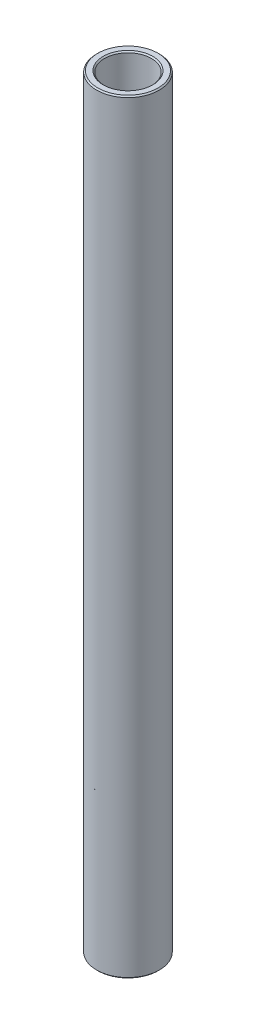
ISO-10303-21;
HEADER;
FILE_DESCRIPTION(('STEP AP214'),'2;1');
FILE_NAME('part.step','',(''),(''),'','','');
FILE_SCHEMA(('AUTOMOTIVE_DESIGN { 1 0 10303 214 1 1 1 1 }'));
ENDSEC;
DATA;
#1=APPLICATION_CONTEXT('core data for automotive mechanical design processes');
#2=APPLICATION_PROTOCOL_DEFINITION('international standard','automotive_design',2000,#1);
#3=PRODUCT_CONTEXT('',#1,'mechanical');
#4=PRODUCT('Part','Part','',(#3));
#5=PRODUCT_RELATED_PRODUCT_CATEGORY('part','',(#4));
#6=PRODUCT_DEFINITION_FORMATION('','',#4);
#7=PRODUCT_DEFINITION_CONTEXT('part definition',#1,'design');
#8=PRODUCT_DEFINITION('design','',#6,#7);
#9=PRODUCT_DEFINITION_SHAPE('','',#8);
#10=(LENGTH_UNIT() NAMED_UNIT(*) SI_UNIT(.MILLI.,.METRE.));
#11=(NAMED_UNIT(*) PLANE_ANGLE_UNIT() SI_UNIT($,.RADIAN.));
#12=(NAMED_UNIT(*) SI_UNIT($,.STERADIAN.) SOLID_ANGLE_UNIT());
#13=UNCERTAINTY_MEASURE_WITH_UNIT(LENGTH_MEASURE(1.E-05),#10,'distance_accuracy_value','');
#14=(GEOMETRIC_REPRESENTATION_CONTEXT(3) GLOBAL_UNCERTAINTY_ASSIGNED_CONTEXT((#13)) GLOBAL_UNIT_ASSIGNED_CONTEXT((#10,
#11,#12)) REPRESENTATION_CONTEXT('',''));
#15=CARTESIAN_POINT('',(0.,0.,0.));
#16=DIRECTION('',(0.,0.,1.));
#17=DIRECTION('',(1.,0.,0.));
#18=AXIS2_PLACEMENT_3D('',#15,#16,#17);
#19=CARTESIAN_POINT('',(0.,11.60859375,0.));
#20=DIRECTION('',(0.,1.,0.));
#21=DIRECTION('',(-1.,0.,0.));
#22=AXIS2_PLACEMENT_3D('',#19,#20,#21);
#23=CYLINDRICAL_SURFACE('',#22,4.7625);
#24=CARTESIAN_POINT('',(0.,-77.136625,0.));
#25=DIRECTION('',(0.,1.,0.));
#26=DIRECTION('',(-1.,0.,0.));
#27=AXIS2_PLACEMENT_3D('',#24,#25,#26);
#28=CIRCLE('',#27,4.7625);
#29=CARTESIAN_POINT('',(-4.76250000000001,-77.136625,0.));
#30=VERTEX_POINT('',#29);
#31=EDGE_CURVE('E50',#30,#30,#28,.F.);
#32=ORIENTED_EDGE('',*,*,#31,.T.);
#33=EDGE_LOOP('',(#32));
#34=FACE_BOUND('',#33,.T.);
#35=CARTESIAN_POINT('',(0.,77.136625,0.));
#36=DIRECTION('',(0.,-1.,0.));
#37=DIRECTION('',(1.,0.,0.));
#38=AXIS2_PLACEMENT_3D('',#35,#36,#37);
#39=CIRCLE('',#38,4.7625);
#40=CARTESIAN_POINT('',(4.76250000000001,77.136625,0.));
#41=VERTEX_POINT('',#40);
#42=EDGE_CURVE('E53',#41,#41,#39,.F.);
#43=ORIENTED_EDGE('',*,*,#42,.T.);
#44=EDGE_LOOP('',(#43));
#45=FACE_BOUND('',#44,.T.);
#46=ADVANCED_FACE('F30',(#34,#45),#23,.F.);
#47=CARTESIAN_POINT('',(4.76249999999999,77.390625,0.));
#48=DIRECTION('',(0.,-1.,0.));
#49=DIRECTION('',(1.,0.,0.));
#50=AXIS2_PLACEMENT_3D('',#47,#48,#49);
#51=PLANE('',#50);
#52=CARTESIAN_POINT('',(0.,77.390625,0.));
#53=DIRECTION('',(0.,-1.,0.));
#54=DIRECTION('',(1.,0.,0.));
#55=AXIS2_PLACEMENT_3D('',#52,#53,#54);
#56=CIRCLE('',#55,6.09599999999999);
#57=CARTESIAN_POINT('',(6.096,77.390625,0.));
#58=VERTEX_POINT('',#57);
#59=EDGE_CURVE('E10',#58,#58,#56,.F.);
#60=ORIENTED_EDGE('',*,*,#59,.T.);
#61=EDGE_LOOP('',(#60));
#62=FACE_BOUND('',#61,.T.);
#63=CARTESIAN_POINT('',(0.,77.390625,0.));
#64=DIRECTION('',(0.,-1.,0.));
#65=DIRECTION('',(1.,0.,0.));
#66=AXIS2_PLACEMENT_3D('',#63,#64,#65);
#67=CIRCLE('',#66,5.01650000000001);
#68=CARTESIAN_POINT('',(5.01650000000002,77.390625,0.));
#69=VERTEX_POINT('',#68);
#70=EDGE_CURVE('E37',#69,#69,#67,.T.);
#71=ORIENTED_EDGE('',*,*,#70,.T.);
#72=EDGE_LOOP('',(#71));
#73=FACE_BOUND('',#72,.T.);
#74=ADVANCED_FACE('F76',(#62,#73),#51,.F.);
#75=CARTESIAN_POINT('',(0.,11.60859375,0.));
#76=DIRECTION('',(0.,1.,0.));
#77=DIRECTION('',(-1.,0.,0.));
#78=AXIS2_PLACEMENT_3D('',#75,#76,#77);
#79=CYLINDRICAL_SURFACE('',#78,6.35);
#80=CARTESIAN_POINT('',(0.,-77.136625,0.));
#81=DIRECTION('',(0.,1.,0.));
#82=DIRECTION('',(-1.,0.,0.));
#83=AXIS2_PLACEMENT_3D('',#80,#81,#82);
#84=CIRCLE('',#83,6.35);
#85=CARTESIAN_POINT('',(-6.35000000000001,-77.136625,0.));
#86=VERTEX_POINT('',#85);
#87=EDGE_CURVE('E41',#86,#86,#84,.T.);
#88=ORIENTED_EDGE('',*,*,#87,.T.);
#89=EDGE_LOOP('',(#88));
#90=FACE_BOUND('',#89,.T.);
#91=CARTESIAN_POINT('',(0.,77.136625,0.));
#92=DIRECTION('',(0.,-1.,0.));
#93=DIRECTION('',(1.,0.,0.));
#94=AXIS2_PLACEMENT_3D('',#91,#92,#93);
#95=CIRCLE('',#94,6.35);
#96=CARTESIAN_POINT('',(6.35000000000001,77.136625,0.));
#97=VERTEX_POINT('',#96);
#98=EDGE_CURVE('E45',#97,#97,#95,.T.);
#99=ORIENTED_EDGE('',*,*,#98,.T.);
#100=EDGE_LOOP('',(#99));
#101=FACE_BOUND('',#100,.T.);
#102=ADVANCED_FACE('F73',(#90,#101),#79,.T.);
#103=CARTESIAN_POINT('',(6.35000000000001,-77.390625,0.));
#104=DIRECTION('',(0.,1.,0.));
#105=DIRECTION('',(-1.,0.,0.));
#106=AXIS2_PLACEMENT_3D('',#103,#104,#105);
#107=PLANE('',#106);
#108=CARTESIAN_POINT('',(0.,-77.390625,0.));
#109=DIRECTION('',(0.,1.,0.));
#110=DIRECTION('',(-1.,0.,0.));
#111=AXIS2_PLACEMENT_3D('',#108,#109,#110);
#112=CIRCLE('',#111,5.01650000000001);
#113=CARTESIAN_POINT('',(-5.01650000000001,-77.390625,0.));
#114=VERTEX_POINT('',#113);
#115=EDGE_CURVE('E56',#114,#114,#112,.T.);
#116=ORIENTED_EDGE('',*,*,#115,.T.);
#117=EDGE_LOOP('',(#116));
#118=FACE_BOUND('',#117,.T.);
#119=CARTESIAN_POINT('',(0.,-77.390625,0.));
#120=DIRECTION('',(0.,1.,0.));
#121=DIRECTION('',(-1.,0.,0.));
#122=AXIS2_PLACEMENT_3D('',#119,#120,#121);
#123=CIRCLE('',#122,6.09600000000003);
#124=CARTESIAN_POINT('',(-6.09600000000004,-77.390625,0.));
#125=VERTEX_POINT('',#124);
#126=EDGE_CURVE('E59',#125,#125,#123,.F.);
#127=ORIENTED_EDGE('',*,*,#126,.T.);
#128=EDGE_LOOP('',(#127));
#129=FACE_BOUND('',#128,.T.);
#130=ADVANCED_FACE('F63',(#118,#129),#107,.F.);
#131=CARTESIAN_POINT('',(0.,-77.390625,0.));
#132=DIRECTION('',(0.,-1.,0.));
#133=DIRECTION('',(1.,0.,0.));
#134=AXIS2_PLACEMENT_3D('',#131,#132,#133);
#135=CONICAL_SURFACE('',#134,5.01650000000001,0.785398163397453);
#136=ORIENTED_EDGE('',*,*,#31,.F.);
#137=EDGE_LOOP('',(#136));
#138=FACE_BOUND('',#137,.T.);
#139=ORIENTED_EDGE('',*,*,#115,.F.);
#140=EDGE_LOOP('',(#139));
#141=FACE_BOUND('',#140,.T.);
#142=ADVANCED_FACE('F69',(#138,#141),#135,.F.);
#143=CARTESIAN_POINT('',(0.,-77.136625,0.));
#144=DIRECTION('',(0.,1.,0.));
#145=DIRECTION('',(-1.,0.,0.));
#146=AXIS2_PLACEMENT_3D('',#143,#144,#145);
#147=CONICAL_SURFACE('',#146,6.35,0.78539816339746);
#148=ORIENTED_EDGE('',*,*,#126,.F.);
#149=EDGE_LOOP('',(#148));
#150=FACE_BOUND('',#149,.T.);
#151=ORIENTED_EDGE('',*,*,#87,.F.);
#152=EDGE_LOOP('',(#151));
#153=FACE_BOUND('',#152,.T.);
#154=ADVANCED_FACE('F65',(#150,#153),#147,.T.);
#155=CARTESIAN_POINT('',(0.,77.390625,0.));
#156=DIRECTION('',(0.,-1.,0.));
#157=DIRECTION('',(1.,0.,0.));
#158=AXIS2_PLACEMENT_3D('',#155,#156,#157);
#159=CONICAL_SURFACE('',#158,6.09599999999999,0.78539816339746);
#160=ORIENTED_EDGE('',*,*,#98,.F.);
#161=EDGE_LOOP('',(#160));
#162=FACE_BOUND('',#161,.T.);
#163=ORIENTED_EDGE('',*,*,#59,.F.);
#164=EDGE_LOOP('',(#163));
#165=FACE_BOUND('',#164,.T.);
#166=ADVANCED_FACE('F68',(#162,#165),#159,.T.);
#167=CARTESIAN_POINT('',(0.,77.136625,0.));
#168=DIRECTION('',(0.,1.,0.));
#169=DIRECTION('',(-1.,0.,0.));
#170=AXIS2_PLACEMENT_3D('',#167,#168,#169);
#171=CONICAL_SURFACE('',#170,4.7625,0.785398163397453);
#172=ORIENTED_EDGE('',*,*,#70,.F.);
#173=EDGE_LOOP('',(#172));
#174=FACE_BOUND('',#173,.T.);
#175=ORIENTED_EDGE('',*,*,#42,.F.);
#176=EDGE_LOOP('',(#175));
#177=FACE_BOUND('',#176,.T.);
#178=ADVANCED_FACE('F32',(#174,#177),#171,.F.);
#179=CLOSED_SHELL('',(#46,#74,#102,#130,#142,#154,#166,#178));
#180=MANIFOLD_SOLID_BREP('B2',#179);
#181=ADVANCED_BREP_SHAPE_REPRESENTATION('',(#18,#180),#14);
#182=SHAPE_DEFINITION_REPRESENTATION(#9,#181);
ENDSEC;
END-ISO-10303-21;
